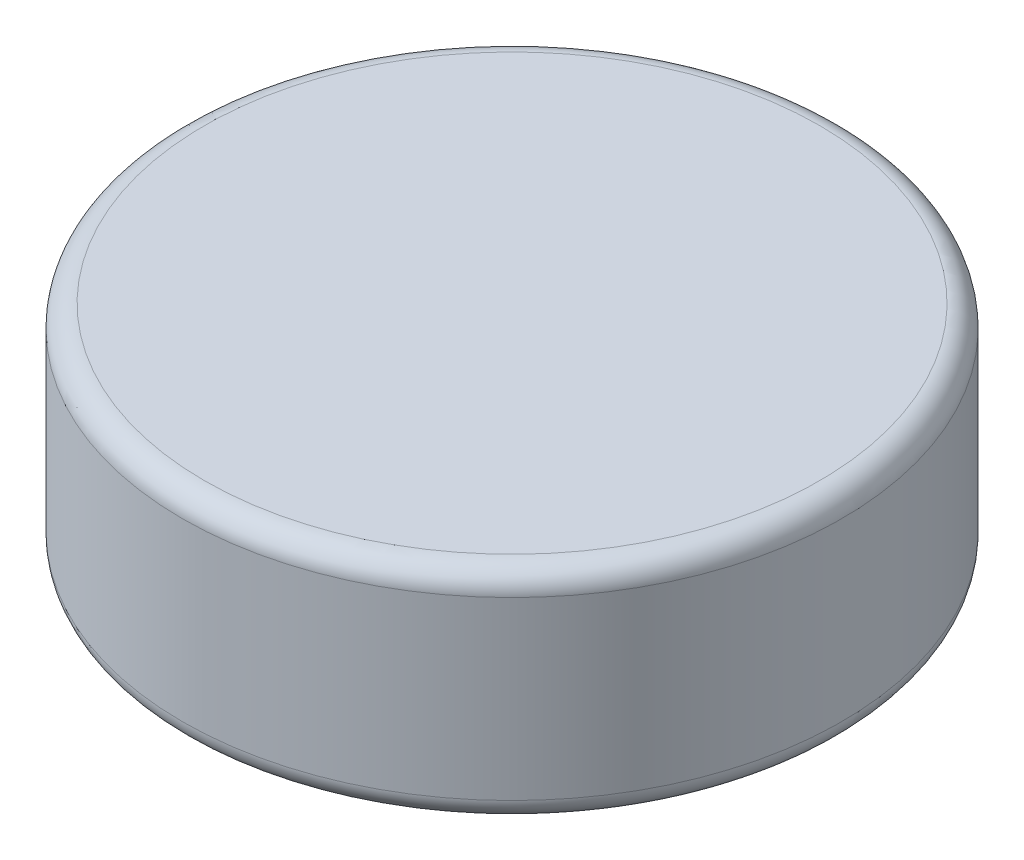
ISO-10303-21;
HEADER;
FILE_DESCRIPTION(('STEP AP214'),'2;1');
FILE_NAME('part.step','',(''),(''),'','','');
FILE_SCHEMA(('AUTOMOTIVE_DESIGN { 1 0 10303 214 1 1 1 1 }'));
ENDSEC;
DATA;
#1=APPLICATION_CONTEXT('core data for automotive mechanical design processes');
#2=APPLICATION_PROTOCOL_DEFINITION('international standard','automotive_design',2000,#1);
#3=PRODUCT_CONTEXT('',#1,'mechanical');
#4=PRODUCT('Part','Part','',(#3));
#5=PRODUCT_RELATED_PRODUCT_CATEGORY('part','',(#4));
#6=PRODUCT_DEFINITION_FORMATION('','',#4);
#7=PRODUCT_DEFINITION_CONTEXT('part definition',#1,'design');
#8=PRODUCT_DEFINITION('design','',#6,#7);
#9=PRODUCT_DEFINITION_SHAPE('','',#8);
#10=(LENGTH_UNIT() NAMED_UNIT(*) SI_UNIT(.MILLI.,.METRE.));
#11=(NAMED_UNIT(*) PLANE_ANGLE_UNIT() SI_UNIT($,.RADIAN.));
#12=(NAMED_UNIT(*) SI_UNIT($,.STERADIAN.) SOLID_ANGLE_UNIT());
#13=UNCERTAINTY_MEASURE_WITH_UNIT(LENGTH_MEASURE(1.E-05),#10,'distance_accuracy_value','');
#14=(GEOMETRIC_REPRESENTATION_CONTEXT(3) GLOBAL_UNCERTAINTY_ASSIGNED_CONTEXT((#13)) GLOBAL_UNIT_ASSIGNED_CONTEXT((#10,
#11,#12)) REPRESENTATION_CONTEXT('',''));
#15=CARTESIAN_POINT('',(0.,0.,0.));
#16=DIRECTION('',(0.,0.,1.));
#17=DIRECTION('',(1.,0.,0.));
#18=AXIS2_PLACEMENT_3D('',#15,#16,#17);
#19=CARTESIAN_POINT('',(0.,2.,0.));
#20=DIRECTION('',(0.,-1.,0.));
#21=DIRECTION('',(0.,0.,-1.));
#22=AXIS2_PLACEMENT_3D('',#19,#20,#21);
#23=CYLINDRICAL_SURFACE('',#22,3.);
#24=CARTESIAN_POINT('',(0.,1.8,0.));
#25=DIRECTION('',(0.,1.,0.));
#26=DIRECTION('',(0.,0.,1.));
#27=AXIS2_PLACEMENT_3D('',#24,#25,#26);
#28=CIRCLE('',#27,3.);
#29=CARTESIAN_POINT('',(0.,1.8,3.));
#30=VERTEX_POINT('',#29);
#31=EDGE_CURVE('E43',#30,#30,#28,.F.);
#32=ORIENTED_EDGE('',*,*,#31,.T.);
#33=EDGE_LOOP('',(#32));
#34=FACE_BOUND('',#33,.T.);
#35=CARTESIAN_POINT('',(0.,0.2,0.));
#36=DIRECTION('',(0.,1.,0.));
#37=DIRECTION('',(0.,0.,1.));
#38=AXIS2_PLACEMENT_3D('',#35,#36,#37);
#39=CIRCLE('',#38,3.);
#40=CARTESIAN_POINT('',(0.,0.2,3.));
#41=VERTEX_POINT('',#40);
#42=EDGE_CURVE('E47',#41,#41,#39,.T.);
#43=ORIENTED_EDGE('',*,*,#42,.T.);
#44=EDGE_LOOP('',(#43));
#45=FACE_BOUND('',#44,.T.);
#46=ADVANCED_FACE('F36',(#34,#45),#23,.T.);
#47=CARTESIAN_POINT('',(0.,2.,0.));
#48=DIRECTION('',(0.,1.,0.));
#49=DIRECTION('',(0.,0.,1.));
#50=AXIS2_PLACEMENT_3D('',#47,#48,#49);
#51=PLANE('',#50);
#52=CARTESIAN_POINT('',(0.,2.,0.));
#53=DIRECTION('',(0.,1.,0.));
#54=DIRECTION('',(0.,0.,1.));
#55=AXIS2_PLACEMENT_3D('',#52,#53,#54);
#56=CIRCLE('',#55,2.8);
#57=CARTESIAN_POINT('',(0.,2.,2.8));
#58=VERTEX_POINT('',#57);
#59=EDGE_CURVE('E51',#58,#58,#56,.T.);
#60=ORIENTED_EDGE('',*,*,#59,.T.);
#61=EDGE_LOOP('',(#60));
#62=FACE_BOUND('',#61,.T.);
#63=ADVANCED_FACE('F57',(#62),#51,.T.);
#64=CARTESIAN_POINT('',(0.,0.,0.));
#65=DIRECTION('',(0.,1.,0.));
#66=DIRECTION('',(0.,0.,1.));
#67=AXIS2_PLACEMENT_3D('',#64,#65,#66);
#68=PLANE('',#67);
#69=CARTESIAN_POINT('',(0.,0.,0.));
#70=DIRECTION('',(0.,1.,0.));
#71=DIRECTION('',(0.,0.,1.));
#72=AXIS2_PLACEMENT_3D('',#69,#70,#71);
#73=CIRCLE('',#72,2.8);
#74=CARTESIAN_POINT('',(0.,0.,2.8));
#75=VERTEX_POINT('',#74);
#76=EDGE_CURVE('E10',#75,#75,#73,.F.);
#77=ORIENTED_EDGE('',*,*,#76,.T.);
#78=EDGE_LOOP('',(#77));
#79=FACE_BOUND('',#78,.T.);
#80=ADVANCED_FACE('F61',(#79),#68,.F.);
#81=CARTESIAN_POINT('',(0.,1.8,0.));
#82=DIRECTION('',(0.,1.,0.));
#83=DIRECTION('',(0.,0.,1.));
#84=AXIS2_PLACEMENT_3D('',#81,#82,#83);
#85=TOROIDAL_SURFACE('',#84,2.8,0.2);
#86=ORIENTED_EDGE('',*,*,#31,.F.);
#87=EDGE_LOOP('',(#86));
#88=FACE_BOUND('',#87,.T.);
#89=ORIENTED_EDGE('',*,*,#59,.F.);
#90=EDGE_LOOP('',(#89));
#91=FACE_BOUND('',#90,.T.);
#92=ADVANCED_FACE('F59',(#88,#91),#85,.T.);
#93=CARTESIAN_POINT('',(0.,0.2,0.));
#94=DIRECTION('',(0.,1.,0.));
#95=DIRECTION('',(0.,0.,1.));
#96=AXIS2_PLACEMENT_3D('',#93,#94,#95);
#97=TOROIDAL_SURFACE('',#96,2.8,0.2);
#98=ORIENTED_EDGE('',*,*,#76,.F.);
#99=EDGE_LOOP('',(#98));
#100=FACE_BOUND('',#99,.T.);
#101=ORIENTED_EDGE('',*,*,#42,.F.);
#102=EDGE_LOOP('',(#101));
#103=FACE_BOUND('',#102,.T.);
#104=ADVANCED_FACE('F38',(#100,#103),#97,.T.);
#105=CLOSED_SHELL('',(#46,#63,#80,#92,#104));
#106=MANIFOLD_SOLID_BREP('B2',#105);
#107=ADVANCED_BREP_SHAPE_REPRESENTATION('',(#18,#106),#14);
#108=SHAPE_DEFINITION_REPRESENTATION(#9,#107);
ENDSEC;
END-ISO-10303-21;
